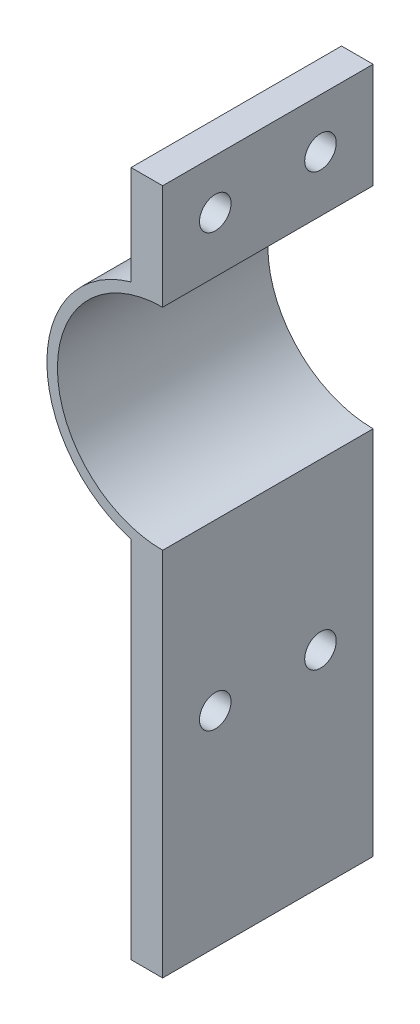
ISO-10303-21;
HEADER;
FILE_DESCRIPTION(('STEP AP214'),'2;1');
FILE_NAME('part.step','',(''),(''),'','','');
FILE_SCHEMA(('AUTOMOTIVE_DESIGN { 1 0 10303 214 1 1 1 1 }'));
ENDSEC;
DATA;
#1=APPLICATION_CONTEXT('core data for automotive mechanical design processes');
#2=APPLICATION_PROTOCOL_DEFINITION('international standard','automotive_design',2000,#1);
#3=PRODUCT_CONTEXT('',#1,'mechanical');
#4=PRODUCT('Part','Part','',(#3));
#5=PRODUCT_RELATED_PRODUCT_CATEGORY('part','',(#4));
#6=PRODUCT_DEFINITION_FORMATION('','',#4);
#7=PRODUCT_DEFINITION_CONTEXT('part definition',#1,'design');
#8=PRODUCT_DEFINITION('design','',#6,#7);
#9=PRODUCT_DEFINITION_SHAPE('','',#8);
#10=(LENGTH_UNIT() NAMED_UNIT(*) SI_UNIT(.MILLI.,.METRE.));
#11=(NAMED_UNIT(*) PLANE_ANGLE_UNIT() SI_UNIT($,.RADIAN.));
#12=(NAMED_UNIT(*) SI_UNIT($,.STERADIAN.) SOLID_ANGLE_UNIT());
#13=UNCERTAINTY_MEASURE_WITH_UNIT(LENGTH_MEASURE(1.E-05),#10,'distance_accuracy_value','');
#14=(GEOMETRIC_REPRESENTATION_CONTEXT(3) GLOBAL_UNCERTAINTY_ASSIGNED_CONTEXT((#13)) GLOBAL_UNIT_ASSIGNED_CONTEXT((#10,
#11,#12)) REPRESENTATION_CONTEXT('',''));
#15=CARTESIAN_POINT('',(0.,0.,0.));
#16=DIRECTION('',(0.,0.,1.));
#17=DIRECTION('',(1.,0.,0.));
#18=AXIS2_PLACEMENT_3D('',#15,#16,#17);
#19=CARTESIAN_POINT('',(-3.,0.,20.));
#20=DIRECTION('',(1.,0.,0.));
#21=DIRECTION('',(0.,1.,0.));
#22=AXIS2_PLACEMENT_3D('',#19,#20,#21);
#23=PLANE('',#22);
#24=CARTESIAN_POINT('',(-3.,15.2915026221292,5.));
#25=DIRECTION('',(-1.,0.,0.));
#26=DIRECTION('',(0.,0.,1.));
#27=AXIS2_PLACEMENT_3D('',#24,#25,#26);
#28=CIRCLE('',#27,1.5);
#29=CARTESIAN_POINT('',(-3.,15.2915026221292,6.5));
#30=VERTEX_POINT('',#29);
#31=EDGE_CURVE('E171',#30,#30,#28,.T.);
#32=ORIENTED_EDGE('',*,*,#31,.F.);
#33=EDGE_LOOP('',(#32));
#34=FACE_BOUND('',#33,.T.);
#35=CARTESIAN_POINT('',(-3.,15.2915026221292,15.));
#36=DIRECTION('',(-1.,0.,0.));
#37=DIRECTION('',(0.,0.,1.));
#38=AXIS2_PLACEMENT_3D('',#35,#36,#37);
#39=CIRCLE('',#38,1.5);
#40=CARTESIAN_POINT('',(-3.,15.2915026221292,16.5));
#41=VERTEX_POINT('',#40);
#42=EDGE_CURVE('E225',#41,#41,#39,.T.);
#43=ORIENTED_EDGE('',*,*,#42,.F.);
#44=EDGE_LOOP('',(#43));
#45=FACE_BOUND('',#44,.T.);
#46=DIRECTION('',(0.,-1.,0.));
#47=VECTOR('',#46,1.);
#48=CARTESIAN_POINT('',(-3.,0.,0.));
#49=LINE('',#48,#47);
#50=CARTESIAN_POINT('',(-3.,20.,0.));
#51=VERTEX_POINT('',#50);
#52=CARTESIAN_POINT('',(-3.,10.5830052442584,0.));
#53=VERTEX_POINT('',#52);
#54=EDGE_CURVE('E137',#51,#53,#49,.T.);
#55=ORIENTED_EDGE('',*,*,#54,.T.);
#56=DIRECTION('',(0.,0.,-1.));
#57=VECTOR('',#56,1.);
#58=CARTESIAN_POINT('',(-3.,10.5830052442584,20.));
#59=LINE('',#58,#57);
#60=CARTESIAN_POINT('',(-3.,10.5830052442584,20.));
#61=VERTEX_POINT('',#60);
#62=EDGE_CURVE('E11',#61,#53,#59,.T.);
#63=ORIENTED_EDGE('',*,*,#62,.F.);
#64=DIRECTION('',(0.,-1.,0.));
#65=VECTOR('',#64,1.);
#66=CARTESIAN_POINT('',(-3.,0.,20.));
#67=LINE('',#66,#65);
#68=CARTESIAN_POINT('',(-3.,20.,20.));
#69=VERTEX_POINT('',#68);
#70=EDGE_CURVE('E156',#69,#61,#67,.T.);
#71=ORIENTED_EDGE('',*,*,#70,.F.);
#72=DIRECTION('',(0.,0.,-1.));
#73=VECTOR('',#72,1.);
#74=CARTESIAN_POINT('',(-3.,20.,20.));
#75=LINE('',#74,#73);
#76=EDGE_CURVE('E136',#69,#51,#75,.T.);
#77=ORIENTED_EDGE('',*,*,#76,.T.);
#78=EDGE_LOOP('',(#55,#63,#71,#77));
#79=FACE_BOUND('',#78,.T.);
#80=ADVANCED_FACE('F37',(#34,#45,#79),#23,.F.);
#81=CARTESIAN_POINT('',(0.,0.,20.));
#82=DIRECTION('',(0.,0.,-1.));
#83=DIRECTION('',(-1.,0.,0.));
#84=AXIS2_PLACEMENT_3D('',#81,#82,#83);
#85=CYLINDRICAL_SURFACE('',#84,11.);
#86=CARTESIAN_POINT('',(0.,0.,0.));
#87=DIRECTION('',(0.,0.,1.));
#88=DIRECTION('',(1.,0.,0.));
#89=AXIS2_PLACEMENT_3D('',#86,#87,#88);
#90=CIRCLE('',#89,11.);
#91=CARTESIAN_POINT('',(-3.,-10.5830052442584,0.));
#92=VERTEX_POINT('',#91);
#93=EDGE_CURVE('E140',#53,#92,#90,.T.);
#94=ORIENTED_EDGE('',*,*,#93,.T.);
#95=DIRECTION('',(0.,0.,-1.));
#96=VECTOR('',#95,1.);
#97=CARTESIAN_POINT('',(-3.,-10.5830052442584,20.));
#98=LINE('',#97,#96);
#99=CARTESIAN_POINT('',(-3.,-10.5830052442584,20.));
#100=VERTEX_POINT('',#99);
#101=EDGE_CURVE('E46',#100,#92,#98,.T.);
#102=ORIENTED_EDGE('',*,*,#101,.F.);
#103=CARTESIAN_POINT('',(0.,0.,20.));
#104=DIRECTION('',(0.,0.,1.));
#105=DIRECTION('',(1.,0.,0.));
#106=AXIS2_PLACEMENT_3D('',#103,#104,#105);
#107=CIRCLE('',#106,11.);
#108=EDGE_CURVE('E97',#61,#100,#107,.T.);
#109=ORIENTED_EDGE('',*,*,#108,.F.);
#110=ORIENTED_EDGE('',*,*,#62,.T.);
#111=EDGE_LOOP('',(#94,#102,#109,#110));
#112=FACE_BOUND('',#111,.T.);
#113=ADVANCED_FACE('F214',(#112),#85,.T.);
#114=CARTESIAN_POINT('',(-3.,0.,20.));
#115=DIRECTION('',(-1.,0.,0.));
#116=DIRECTION('',(0.,-1.,0.));
#117=AXIS2_PLACEMENT_3D('',#114,#115,#116);
#118=PLANE('',#117);
#119=CARTESIAN_POINT('',(-3.,-25.7,15.));
#120=DIRECTION('',(-1.,0.,0.));
#121=DIRECTION('',(0.,0.,1.));
#122=AXIS2_PLACEMENT_3D('',#119,#120,#121);
#123=CIRCLE('',#122,1.5);
#124=CARTESIAN_POINT('',(-3.,-25.7,16.5));
#125=VERTEX_POINT('',#124);
#126=EDGE_CURVE('E184',#125,#125,#123,.T.);
#127=ORIENTED_EDGE('',*,*,#126,.F.);
#128=EDGE_LOOP('',(#127));
#129=FACE_BOUND('',#128,.T.);
#130=CARTESIAN_POINT('',(-3.,-25.7,5.));
#131=DIRECTION('',(-1.,0.,0.));
#132=DIRECTION('',(0.,0.,1.));
#133=AXIS2_PLACEMENT_3D('',#130,#131,#132);
#134=CIRCLE('',#133,1.5);
#135=CARTESIAN_POINT('',(-3.,-25.7,6.5));
#136=VERTEX_POINT('',#135);
#137=EDGE_CURVE('E167',#136,#136,#134,.T.);
#138=ORIENTED_EDGE('',*,*,#137,.F.);
#139=EDGE_LOOP('',(#138));
#140=FACE_BOUND('',#139,.T.);
#141=DIRECTION('',(0.,1.,0.));
#142=VECTOR('',#141,1.);
#143=CARTESIAN_POINT('',(-3.,0.,0.));
#144=LINE('',#143,#142);
#145=CARTESIAN_POINT('',(-3.,-45.2,0.));
#146=VERTEX_POINT('',#145);
#147=EDGE_CURVE('E144',#146,#92,#144,.T.);
#148=ORIENTED_EDGE('',*,*,#147,.F.);
#149=DIRECTION('',(0.,0.,-1.));
#150=VECTOR('',#149,1.);
#151=CARTESIAN_POINT('',(-3.,-45.2,20.));
#152=LINE('',#151,#150);
#153=CARTESIAN_POINT('',(-3.,-45.2,20.));
#154=VERTEX_POINT('',#153);
#155=EDGE_CURVE('E162',#154,#146,#152,.T.);
#156=ORIENTED_EDGE('',*,*,#155,.F.);
#157=DIRECTION('',(0.,1.,0.));
#158=VECTOR('',#157,1.);
#159=CARTESIAN_POINT('',(-3.,0.,20.));
#160=LINE('',#159,#158);
#161=EDGE_CURVE('E188',#154,#100,#160,.T.);
#162=ORIENTED_EDGE('',*,*,#161,.T.);
#163=ORIENTED_EDGE('',*,*,#101,.T.);
#164=EDGE_LOOP('',(#148,#156,#162,#163));
#165=FACE_BOUND('',#164,.T.);
#166=ADVANCED_FACE('F197',(#129,#140,#165),#118,.T.);
#167=CARTESIAN_POINT('',(0.,-45.2,20.));
#168=DIRECTION('',(0.,-1.,0.));
#169=DIRECTION('',(0.,0.,-1.));
#170=AXIS2_PLACEMENT_3D('',#167,#168,#169);
#171=PLANE('',#170);
#172=DIRECTION('',(-1.,0.,0.));
#173=VECTOR('',#172,1.);
#174=CARTESIAN_POINT('',(0.,-45.2,0.));
#175=LINE('',#174,#173);
#176=CARTESIAN_POINT('',(0.,-45.2,0.));
#177=VERTEX_POINT('',#176);
#178=EDGE_CURVE('E147',#177,#146,#175,.T.);
#179=ORIENTED_EDGE('',*,*,#178,.F.);
#180=DIRECTION('',(0.,0.,-1.));
#181=VECTOR('',#180,1.);
#182=CARTESIAN_POINT('',(0.,-45.2,20.));
#183=LINE('',#182,#181);
#184=CARTESIAN_POINT('',(0.,-45.2,20.));
#185=VERTEX_POINT('',#184);
#186=EDGE_CURVE('E160',#185,#177,#183,.T.);
#187=ORIENTED_EDGE('',*,*,#186,.F.);
#188=DIRECTION('',(-1.,0.,0.));
#189=VECTOR('',#188,1.);
#190=CARTESIAN_POINT('',(0.,-45.2,20.));
#191=LINE('',#190,#189);
#192=EDGE_CURVE('E131',#185,#154,#191,.T.);
#193=ORIENTED_EDGE('',*,*,#192,.T.);
#194=ORIENTED_EDGE('',*,*,#155,.T.);
#195=EDGE_LOOP('',(#179,#187,#193,#194));
#196=FACE_BOUND('',#195,.T.);
#197=ADVANCED_FACE('F193',(#196),#171,.T.);
#198=CARTESIAN_POINT('',(0.,0.,20.));
#199=DIRECTION('',(-1.,0.,0.));
#200=DIRECTION('',(0.,0.,1.));
#201=AXIS2_PLACEMENT_3D('',#198,#199,#200);
#202=PLANE('',#201);
#203=CARTESIAN_POINT('',(0.,-25.7,15.));
#204=DIRECTION('',(-1.,0.,0.));
#205=DIRECTION('',(0.,0.,1.));
#206=AXIS2_PLACEMENT_3D('',#203,#204,#205);
#207=CIRCLE('',#206,1.5);
#208=CARTESIAN_POINT('',(0.,-25.7,16.5));
#209=VERTEX_POINT('',#208);
#210=EDGE_CURVE('E40',#209,#209,#207,.T.);
#211=ORIENTED_EDGE('',*,*,#210,.T.);
#212=EDGE_LOOP('',(#211));
#213=FACE_BOUND('',#212,.T.);
#214=CARTESIAN_POINT('',(0.,-25.7,5.));
#215=DIRECTION('',(-1.,0.,0.));
#216=DIRECTION('',(0.,0.,1.));
#217=AXIS2_PLACEMENT_3D('',#214,#215,#216);
#218=CIRCLE('',#217,1.5);
#219=CARTESIAN_POINT('',(0.,-25.7,6.5));
#220=VERTEX_POINT('',#219);
#221=EDGE_CURVE('E141',#220,#220,#218,.T.);
#222=ORIENTED_EDGE('',*,*,#221,.T.);
#223=EDGE_LOOP('',(#222));
#224=FACE_BOUND('',#223,.T.);
#225=DIRECTION('',(0.,1.,0.));
#226=VECTOR('',#225,1.);
#227=CARTESIAN_POINT('',(0.,0.,0.));
#228=LINE('',#227,#226);
#229=CARTESIAN_POINT('',(0.,-10.,0.));
#230=VERTEX_POINT('',#229);
#231=EDGE_CURVE('E150',#177,#230,#228,.T.);
#232=ORIENTED_EDGE('',*,*,#231,.T.);
#233=DIRECTION('',(0.,0.,-1.));
#234=VECTOR('',#233,1.);
#235=CARTESIAN_POINT('',(0.,-10.,20.));
#236=LINE('',#235,#234);
#237=CARTESIAN_POINT('',(0.,-10.,20.));
#238=VERTEX_POINT('',#237);
#239=EDGE_CURVE('E119',#238,#230,#236,.T.);
#240=ORIENTED_EDGE('',*,*,#239,.F.);
#241=DIRECTION('',(0.,1.,0.));
#242=VECTOR('',#241,1.);
#243=CARTESIAN_POINT('',(0.,0.,20.));
#244=LINE('',#243,#242);
#245=EDGE_CURVE('E128',#185,#238,#244,.T.);
#246=ORIENTED_EDGE('',*,*,#245,.F.);
#247=ORIENTED_EDGE('',*,*,#186,.T.);
#248=EDGE_LOOP('',(#232,#240,#246,#247));
#249=FACE_BOUND('',#248,.T.);
#250=ADVANCED_FACE('F203',(#213,#224,#249),#202,.F.);
#251=CARTESIAN_POINT('',(0.,0.,20.));
#252=DIRECTION('',(0.,0.,-1.));
#253=DIRECTION('',(-1.,0.,0.));
#254=AXIS2_PLACEMENT_3D('',#251,#252,#253);
#255=CYLINDRICAL_SURFACE('',#254,10.);
#256=CARTESIAN_POINT('',(0.,0.,0.));
#257=DIRECTION('',(0.,0.,1.));
#258=DIRECTION('',(1.,0.,0.));
#259=AXIS2_PLACEMENT_3D('',#256,#257,#258);
#260=CIRCLE('',#259,10.);
#261=CARTESIAN_POINT('',(0.,10.,0.));
#262=VERTEX_POINT('',#261);
#263=EDGE_CURVE('E118',#262,#230,#260,.T.);
#264=ORIENTED_EDGE('',*,*,#263,.F.);
#265=DIRECTION('',(0.,0.,-1.));
#266=VECTOR('',#265,1.);
#267=CARTESIAN_POINT('',(0.,10.,20.));
#268=LINE('',#267,#266);
#269=CARTESIAN_POINT('',(0.,10.,20.));
#270=VERTEX_POINT('',#269);
#271=EDGE_CURVE('E112',#270,#262,#268,.T.);
#272=ORIENTED_EDGE('',*,*,#271,.F.);
#273=CARTESIAN_POINT('',(0.,0.,20.));
#274=DIRECTION('',(0.,0.,1.));
#275=DIRECTION('',(1.,0.,0.));
#276=AXIS2_PLACEMENT_3D('',#273,#274,#275);
#277=CIRCLE('',#276,10.);
#278=EDGE_CURVE('E116',#270,#238,#277,.T.);
#279=ORIENTED_EDGE('',*,*,#278,.T.);
#280=ORIENTED_EDGE('',*,*,#239,.T.);
#281=EDGE_LOOP('',(#264,#272,#279,#280));
#282=FACE_BOUND('',#281,.T.);
#283=ADVANCED_FACE('F114',(#282),#255,.F.);
#284=CARTESIAN_POINT('',(0.,0.,20.));
#285=DIRECTION('',(-1.,0.,0.));
#286=DIRECTION('',(0.,0.,1.));
#287=AXIS2_PLACEMENT_3D('',#284,#285,#286);
#288=PLANE('',#287);
#289=CARTESIAN_POINT('',(0.,15.2915026221292,5.));
#290=DIRECTION('',(-1.,0.,0.));
#291=DIRECTION('',(0.,0.,1.));
#292=AXIS2_PLACEMENT_3D('',#289,#290,#291);
#293=CIRCLE('',#292,1.5);
#294=CARTESIAN_POINT('',(0.,15.2915026221292,6.5));
#295=VERTEX_POINT('',#294);
#296=EDGE_CURVE('E170',#295,#295,#293,.T.);
#297=ORIENTED_EDGE('',*,*,#296,.T.);
#298=EDGE_LOOP('',(#297));
#299=FACE_BOUND('',#298,.T.);
#300=CARTESIAN_POINT('',(0.,15.2915026221292,15.));
#301=DIRECTION('',(-1.,0.,0.));
#302=DIRECTION('',(0.,0.,1.));
#303=AXIS2_PLACEMENT_3D('',#300,#301,#302);
#304=CIRCLE('',#303,1.5);
#305=CARTESIAN_POINT('',(0.,15.2915026221292,16.5));
#306=VERTEX_POINT('',#305);
#307=EDGE_CURVE('E168',#306,#306,#304,.T.);
#308=ORIENTED_EDGE('',*,*,#307,.T.);
#309=EDGE_LOOP('',(#308));
#310=FACE_BOUND('',#309,.T.);
#311=DIRECTION('',(0.,1.,0.));
#312=VECTOR('',#311,1.);
#313=CARTESIAN_POINT('',(0.,0.,0.));
#314=LINE('',#313,#312);
#315=CARTESIAN_POINT('',(0.,20.,0.));
#316=VERTEX_POINT('',#315);
#317=EDGE_CURVE('E83',#262,#316,#314,.T.);
#318=ORIENTED_EDGE('',*,*,#317,.T.);
#319=DIRECTION('',(0.,0.,-1.));
#320=VECTOR('',#319,1.);
#321=CARTESIAN_POINT('',(0.,20.,20.));
#322=LINE('',#321,#320);
#323=CARTESIAN_POINT('',(0.,20.,20.));
#324=VERTEX_POINT('',#323);
#325=EDGE_CURVE('E120',#324,#316,#322,.T.);
#326=ORIENTED_EDGE('',*,*,#325,.F.);
#327=DIRECTION('',(0.,1.,0.));
#328=VECTOR('',#327,1.);
#329=CARTESIAN_POINT('',(0.,0.,20.));
#330=LINE('',#329,#328);
#331=EDGE_CURVE('E122',#270,#324,#330,.T.);
#332=ORIENTED_EDGE('',*,*,#331,.F.);
#333=ORIENTED_EDGE('',*,*,#271,.T.);
#334=EDGE_LOOP('',(#318,#326,#332,#333));
#335=FACE_BOUND('',#334,.T.);
#336=ADVANCED_FACE('F123',(#299,#310,#335),#288,.F.);
#337=CARTESIAN_POINT('',(0.,20.,20.));
#338=DIRECTION('',(0.,-1.,0.));
#339=DIRECTION('',(0.,0.,-1.));
#340=AXIS2_PLACEMENT_3D('',#337,#338,#339);
#341=PLANE('',#340);
#342=DIRECTION('',(-1.,0.,0.));
#343=VECTOR('',#342,1.);
#344=CARTESIAN_POINT('',(0.,20.,0.));
#345=LINE('',#344,#343);
#346=EDGE_CURVE('E89',#316,#51,#345,.T.);
#347=ORIENTED_EDGE('',*,*,#346,.T.);
#348=ORIENTED_EDGE('',*,*,#76,.F.);
#349=DIRECTION('',(-1.,0.,0.));
#350=VECTOR('',#349,1.);
#351=CARTESIAN_POINT('',(0.,20.,20.));
#352=LINE('',#351,#350);
#353=EDGE_CURVE('E55',#324,#69,#352,.T.);
#354=ORIENTED_EDGE('',*,*,#353,.F.);
#355=ORIENTED_EDGE('',*,*,#325,.T.);
#356=EDGE_LOOP('',(#347,#348,#354,#355));
#357=FACE_BOUND('',#356,.T.);
#358=ADVANCED_FACE('F228',(#357),#341,.F.);
#359=CARTESIAN_POINT('',(0.,0.,20.));
#360=DIRECTION('',(0.,0.,1.));
#361=DIRECTION('',(1.,0.,0.));
#362=AXIS2_PLACEMENT_3D('',#359,#360,#361);
#363=PLANE('',#362);
#364=ORIENTED_EDGE('',*,*,#70,.T.);
#365=ORIENTED_EDGE('',*,*,#108,.T.);
#366=ORIENTED_EDGE('',*,*,#161,.F.);
#367=ORIENTED_EDGE('',*,*,#192,.F.);
#368=ORIENTED_EDGE('',*,*,#245,.T.);
#369=ORIENTED_EDGE('',*,*,#278,.F.);
#370=ORIENTED_EDGE('',*,*,#331,.T.);
#371=ORIENTED_EDGE('',*,*,#353,.T.);
#372=EDGE_LOOP('',(#364,#365,#366,#367,#368,#369,#370,#371));
#373=FACE_BOUND('',#372,.T.);
#374=ADVANCED_FACE('F125',(#373),#363,.T.);
#375=CARTESIAN_POINT('',(0.,0.,0.));
#376=DIRECTION('',(0.,0.,1.));
#377=DIRECTION('',(1.,0.,0.));
#378=AXIS2_PLACEMENT_3D('',#375,#376,#377);
#379=PLANE('',#378);
#380=ORIENTED_EDGE('',*,*,#54,.F.);
#381=ORIENTED_EDGE('',*,*,#346,.F.);
#382=ORIENTED_EDGE('',*,*,#317,.F.);
#383=ORIENTED_EDGE('',*,*,#263,.T.);
#384=ORIENTED_EDGE('',*,*,#231,.F.);
#385=ORIENTED_EDGE('',*,*,#178,.T.);
#386=ORIENTED_EDGE('',*,*,#147,.T.);
#387=ORIENTED_EDGE('',*,*,#93,.F.);
#388=EDGE_LOOP('',(#380,#381,#382,#383,#384,#385,#386,#387));
#389=FACE_BOUND('',#388,.T.);
#390=ADVANCED_FACE('F201',(#389),#379,.F.);
#391=CARTESIAN_POINT('',(17.,-25.7,5.));
#392=DIRECTION('',(-1.,0.,0.));
#393=DIRECTION('',(0.,0.,1.));
#394=AXIS2_PLACEMENT_3D('',#391,#392,#393);
#395=CYLINDRICAL_SURFACE('',#394,1.5);
#396=ORIENTED_EDGE('',*,*,#137,.T.);
#397=EDGE_LOOP('',(#396));
#398=FACE_BOUND('',#397,.T.);
#399=ORIENTED_EDGE('',*,*,#221,.F.);
#400=EDGE_LOOP('',(#399));
#401=FACE_BOUND('',#400,.T.);
#402=ADVANCED_FACE('F239',(#398,#401),#395,.F.);
#403=CARTESIAN_POINT('',(17.,15.2915026221292,15.));
#404=DIRECTION('',(-1.,0.,0.));
#405=DIRECTION('',(0.,0.,1.));
#406=AXIS2_PLACEMENT_3D('',#403,#404,#405);
#407=CYLINDRICAL_SURFACE('',#406,1.5);
#408=ORIENTED_EDGE('',*,*,#42,.T.);
#409=EDGE_LOOP('',(#408));
#410=FACE_BOUND('',#409,.T.);
#411=ORIENTED_EDGE('',*,*,#307,.F.);
#412=EDGE_LOOP('',(#411));
#413=FACE_BOUND('',#412,.T.);
#414=ADVANCED_FACE('F243',(#410,#413),#407,.F.);
#415=CARTESIAN_POINT('',(17.,15.2915026221292,5.));
#416=DIRECTION('',(-1.,0.,0.));
#417=DIRECTION('',(0.,0.,1.));
#418=AXIS2_PLACEMENT_3D('',#415,#416,#417);
#419=CYLINDRICAL_SURFACE('',#418,1.5);
#420=ORIENTED_EDGE('',*,*,#31,.T.);
#421=EDGE_LOOP('',(#420));
#422=FACE_BOUND('',#421,.T.);
#423=ORIENTED_EDGE('',*,*,#296,.F.);
#424=EDGE_LOOP('',(#423));
#425=FACE_BOUND('',#424,.T.);
#426=ADVANCED_FACE('F247',(#422,#425),#419,.F.);
#427=CARTESIAN_POINT('',(17.,-25.7,15.));
#428=DIRECTION('',(-1.,0.,0.));
#429=DIRECTION('',(0.,0.,1.));
#430=AXIS2_PLACEMENT_3D('',#427,#428,#429);
#431=CYLINDRICAL_SURFACE('',#430,1.5);
#432=ORIENTED_EDGE('',*,*,#126,.T.);
#433=EDGE_LOOP('',(#432));
#434=FACE_BOUND('',#433,.T.);
#435=ORIENTED_EDGE('',*,*,#210,.F.);
#436=EDGE_LOOP('',(#435));
#437=FACE_BOUND('',#436,.T.);
#438=ADVANCED_FACE('F244',(#434,#437),#431,.F.);
#439=CLOSED_SHELL('',(#80,#113,#166,#197,#250,#283,#336,#358,#374,#390,#402,#414,#426,#438));
#440=MANIFOLD_SOLID_BREP('B2',#439);
#441=ADVANCED_BREP_SHAPE_REPRESENTATION('',(#18,#440),#14);
#442=SHAPE_DEFINITION_REPRESENTATION(#9,#441);
ENDSEC;
END-ISO-10303-21;
